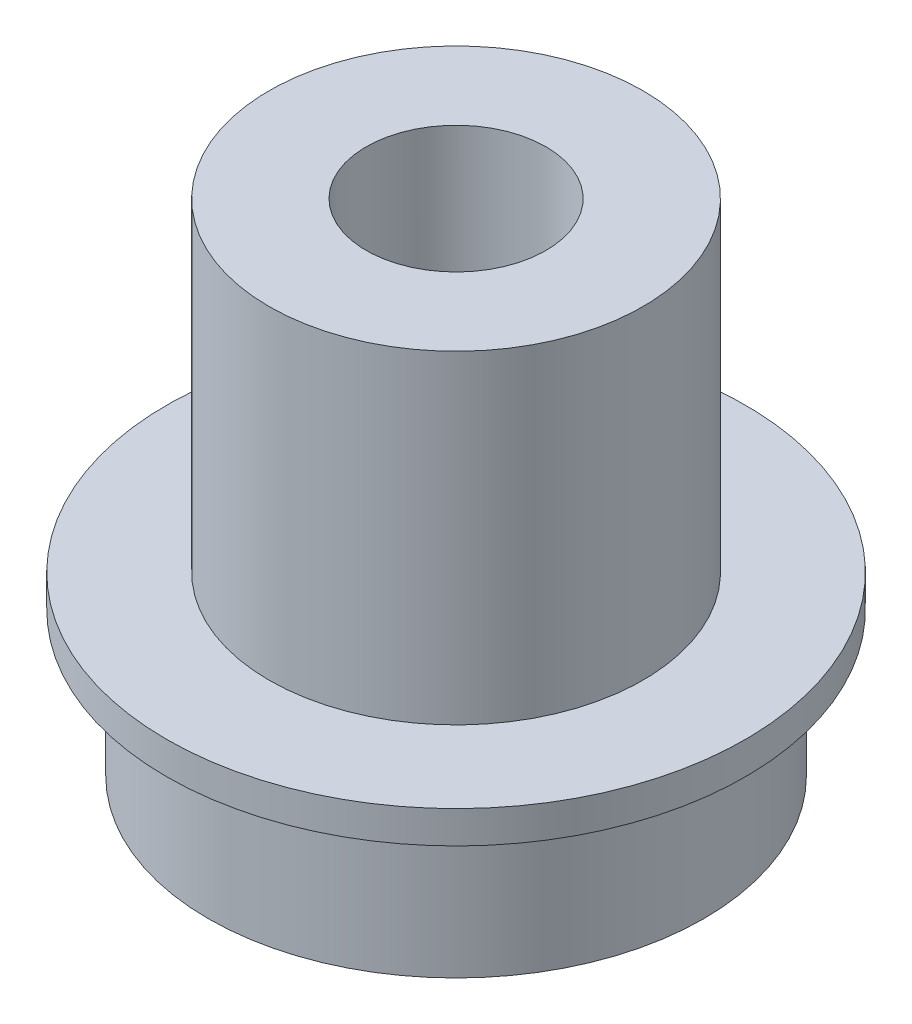
ISO-10303-21;
HEADER;
FILE_DESCRIPTION(('STEP AP214'),'2;1');
FILE_NAME('part.step','',(''),(''),'','','');
FILE_SCHEMA(('AUTOMOTIVE_DESIGN { 1 0 10303 214 1 1 1 1 }'));
ENDSEC;
DATA;
#1=APPLICATION_CONTEXT('core data for automotive mechanical design processes');
#2=APPLICATION_PROTOCOL_DEFINITION('international standard','automotive_design',2000,#1);
#3=PRODUCT_CONTEXT('',#1,'mechanical');
#4=PRODUCT('Part','Part','',(#3));
#5=PRODUCT_RELATED_PRODUCT_CATEGORY('part','',(#4));
#6=PRODUCT_DEFINITION_FORMATION('','',#4);
#7=PRODUCT_DEFINITION_CONTEXT('part definition',#1,'design');
#8=PRODUCT_DEFINITION('design','',#6,#7);
#9=PRODUCT_DEFINITION_SHAPE('','',#8);
#10=(LENGTH_UNIT() NAMED_UNIT(*) SI_UNIT(.MILLI.,.METRE.));
#11=(NAMED_UNIT(*) PLANE_ANGLE_UNIT() SI_UNIT($,.RADIAN.));
#12=(NAMED_UNIT(*) SI_UNIT($,.STERADIAN.) SOLID_ANGLE_UNIT());
#13=UNCERTAINTY_MEASURE_WITH_UNIT(LENGTH_MEASURE(1.E-05),#10,'distance_accuracy_value','');
#14=(GEOMETRIC_REPRESENTATION_CONTEXT(3) GLOBAL_UNCERTAINTY_ASSIGNED_CONTEXT((#13)) GLOBAL_UNIT_ASSIGNED_CONTEXT((#10,
#11,#12)) REPRESENTATION_CONTEXT('',''));
#15=CARTESIAN_POINT('',(0.,0.,0.));
#16=DIRECTION('',(0.,0.,1.));
#17=DIRECTION('',(1.,0.,0.));
#18=AXIS2_PLACEMENT_3D('',#15,#16,#17);
#19=CARTESIAN_POINT('',(0.,0.,0.));
#20=DIRECTION('',(0.,1.,0.));
#21=DIRECTION('',(0.,0.,1.));
#22=AXIS2_PLACEMENT_3D('',#19,#20,#21);
#23=PLANE('',#22);
#24=CARTESIAN_POINT('',(0.,0.,0.));
#25=DIRECTION('',(0.,1.,0.));
#26=DIRECTION('',(0.,0.,1.));
#27=AXIS2_PLACEMENT_3D('',#24,#25,#26);
#28=CIRCLE('',#27,8.7503);
#29=CARTESIAN_POINT('',(0.,0.,8.7503));
#30=VERTEX_POINT('',#29);
#31=EDGE_CURVE('E43',#30,#30,#28,.T.);
#32=ORIENTED_EDGE('',*,*,#31,.F.);
#33=EDGE_LOOP('',(#32));
#34=FACE_BOUND('',#33,.T.);
#35=CARTESIAN_POINT('',(0.,0.,0.));
#36=DIRECTION('',(0.,1.,0.));
#37=DIRECTION('',(0.,0.,1.));
#38=AXIS2_PLACEMENT_3D('',#35,#36,#37);
#39=CIRCLE('',#38,3.175);
#40=CARTESIAN_POINT('',(0.,0.,3.175));
#41=VERTEX_POINT('',#40);
#42=EDGE_CURVE('E50',#41,#41,#39,.T.);
#43=ORIENTED_EDGE('',*,*,#42,.T.);
#44=EDGE_LOOP('',(#43));
#45=FACE_BOUND('',#44,.T.);
#46=ADVANCED_FACE('F39',(#34,#45),#23,.F.);
#47=CARTESIAN_POINT('',(0.,5.08,0.));
#48=DIRECTION('',(0.,-1.,0.));
#49=DIRECTION('',(0.,0.,-1.));
#50=AXIS2_PLACEMENT_3D('',#47,#48,#49);
#51=CYLINDRICAL_SURFACE('',#50,8.7503);
#52=CARTESIAN_POINT('',(0.,5.08,0.));
#53=DIRECTION('',(0.,1.,0.));
#54=DIRECTION('',(0.,0.,1.));
#55=AXIS2_PLACEMENT_3D('',#52,#53,#54);
#56=CIRCLE('',#55,8.7503);
#57=CARTESIAN_POINT('',(0.,5.08,8.7503));
#58=VERTEX_POINT('',#57);
#59=EDGE_CURVE('E10',#58,#58,#56,.T.);
#60=ORIENTED_EDGE('',*,*,#59,.F.);
#61=EDGE_LOOP('',(#60));
#62=FACE_BOUND('',#61,.T.);
#63=ORIENTED_EDGE('',*,*,#31,.T.);
#64=EDGE_LOOP('',(#63));
#65=FACE_BOUND('',#64,.T.);
#66=ADVANCED_FACE('F41',(#62,#65),#51,.T.);
#67=CARTESIAN_POINT('',(0.,5.08,0.));
#68=DIRECTION('',(0.,-1.,0.));
#69=DIRECTION('',(0.,0.,-1.));
#70=AXIS2_PLACEMENT_3D('',#67,#68,#69);
#71=CYLINDRICAL_SURFACE('',#70,3.175);
#72=ORIENTED_EDGE('',*,*,#42,.F.);
#73=EDGE_LOOP('',(#72));
#74=FACE_BOUND('',#73,.T.);
#75=CARTESIAN_POINT('',(0.,17.653,0.));
#76=DIRECTION('',(0.,-1.,0.));
#77=DIRECTION('',(0.,0.,-1.));
#78=AXIS2_PLACEMENT_3D('',#75,#76,#77);
#79=CIRCLE('',#78,3.175);
#80=CARTESIAN_POINT('',(0.,17.653,-3.175));
#81=VERTEX_POINT('',#80);
#82=EDGE_CURVE('E64',#81,#81,#79,.T.);
#83=ORIENTED_EDGE('',*,*,#82,.F.);
#84=EDGE_LOOP('',(#83));
#85=FACE_BOUND('',#84,.T.);
#86=ADVANCED_FACE('F73',(#74,#85),#71,.F.);
#87=CARTESIAN_POINT('',(0.,6.223,0.));
#88=DIRECTION('',(0.,1.,0.));
#89=DIRECTION('',(0.,0.,1.));
#90=AXIS2_PLACEMENT_3D('',#87,#88,#89);
#91=PLANE('',#90);
#92=CARTESIAN_POINT('',(0.,6.223,0.));
#93=DIRECTION('',(0.,1.,0.));
#94=DIRECTION('',(0.,0.,1.));
#95=AXIS2_PLACEMENT_3D('',#92,#93,#94);
#96=CIRCLE('',#95,6.604);
#97=CARTESIAN_POINT('',(0.,6.223,6.604));
#98=VERTEX_POINT('',#97);
#99=EDGE_CURVE('E61',#98,#98,#96,.T.);
#100=ORIENTED_EDGE('',*,*,#99,.F.);
#101=EDGE_LOOP('',(#100));
#102=FACE_BOUND('',#101,.T.);
#103=CARTESIAN_POINT('',(0.,6.223,0.));
#104=DIRECTION('',(0.,1.,0.));
#105=DIRECTION('',(0.,0.,1.));
#106=AXIS2_PLACEMENT_3D('',#103,#104,#105);
#107=CIRCLE('',#106,10.2235);
#108=CARTESIAN_POINT('',(0.,6.223,10.2235));
#109=VERTEX_POINT('',#108);
#110=EDGE_CURVE('E54',#109,#109,#107,.T.);
#111=ORIENTED_EDGE('',*,*,#110,.T.);
#112=EDGE_LOOP('',(#111));
#113=FACE_BOUND('',#112,.T.);
#114=ADVANCED_FACE('F75',(#102,#113),#91,.T.);
#115=CARTESIAN_POINT('',(0.,5.08,0.));
#116=DIRECTION('',(0.,1.,0.));
#117=DIRECTION('',(0.,0.,1.));
#118=AXIS2_PLACEMENT_3D('',#115,#116,#117);
#119=PLANE('',#118);
#120=ORIENTED_EDGE('',*,*,#59,.T.);
#121=EDGE_LOOP('',(#120));
#122=FACE_BOUND('',#121,.T.);
#123=CARTESIAN_POINT('',(0.,5.08,0.));
#124=DIRECTION('',(0.,1.,0.));
#125=DIRECTION('',(0.,0.,1.));
#126=AXIS2_PLACEMENT_3D('',#123,#124,#125);
#127=CIRCLE('',#126,10.2235);
#128=CARTESIAN_POINT('',(0.,5.08,10.2235));
#129=VERTEX_POINT('',#128);
#130=EDGE_CURVE('E55',#129,#129,#127,.T.);
#131=ORIENTED_EDGE('',*,*,#130,.F.);
#132=EDGE_LOOP('',(#131));
#133=FACE_BOUND('',#132,.T.);
#134=ADVANCED_FACE('F82',(#122,#133),#119,.F.);
#135=CARTESIAN_POINT('',(0.,6.223,0.));
#136=DIRECTION('',(0.,-1.,0.));
#137=DIRECTION('',(0.,0.,-1.));
#138=AXIS2_PLACEMENT_3D('',#135,#136,#137);
#139=CYLINDRICAL_SURFACE('',#138,10.2235);
#140=ORIENTED_EDGE('',*,*,#110,.F.);
#141=EDGE_LOOP('',(#140));
#142=FACE_BOUND('',#141,.T.);
#143=ORIENTED_EDGE('',*,*,#130,.T.);
#144=EDGE_LOOP('',(#143));
#145=FACE_BOUND('',#144,.T.);
#146=ADVANCED_FACE('F110',(#142,#145),#139,.T.);
#147=CARTESIAN_POINT('',(0.,17.653,0.));
#148=DIRECTION('',(0.,1.,0.));
#149=DIRECTION('',(0.,0.,1.));
#150=AXIS2_PLACEMENT_3D('',#147,#148,#149);
#151=PLANE('',#150);
#152=ORIENTED_EDGE('',*,*,#82,.T.);
#153=EDGE_LOOP('',(#152));
#154=FACE_BOUND('',#153,.T.);
#155=CARTESIAN_POINT('',(0.,17.653,0.));
#156=DIRECTION('',(0.,1.,0.));
#157=DIRECTION('',(0.,0.,1.));
#158=AXIS2_PLACEMENT_3D('',#155,#156,#157);
#159=CIRCLE('',#158,6.604);
#160=CARTESIAN_POINT('',(0.,17.653,6.604));
#161=VERTEX_POINT('',#160);
#162=EDGE_CURVE('E58',#161,#161,#159,.T.);
#163=ORIENTED_EDGE('',*,*,#162,.T.);
#164=EDGE_LOOP('',(#163));
#165=FACE_BOUND('',#164,.T.);
#166=ADVANCED_FACE('F70',(#154,#165),#151,.T.);
#167=CARTESIAN_POINT('',(0.,17.653,0.));
#168=DIRECTION('',(0.,-1.,0.));
#169=DIRECTION('',(0.,0.,-1.));
#170=AXIS2_PLACEMENT_3D('',#167,#168,#169);
#171=CYLINDRICAL_SURFACE('',#170,6.604);
#172=ORIENTED_EDGE('',*,*,#162,.F.);
#173=EDGE_LOOP('',(#172));
#174=FACE_BOUND('',#173,.T.);
#175=ORIENTED_EDGE('',*,*,#99,.T.);
#176=EDGE_LOOP('',(#175));
#177=FACE_BOUND('',#176,.T.);
#178=ADVANCED_FACE('F135',(#174,#177),#171,.T.);
#179=CLOSED_SHELL('',(#46,#66,#86,#114,#134,#146,#166,#178));
#180=MANIFOLD_SOLID_BREP('B2',#179);
#181=ADVANCED_BREP_SHAPE_REPRESENTATION('',(#18,#180),#14);
#182=SHAPE_DEFINITION_REPRESENTATION(#9,#181);
ENDSEC;
END-ISO-10303-21;
